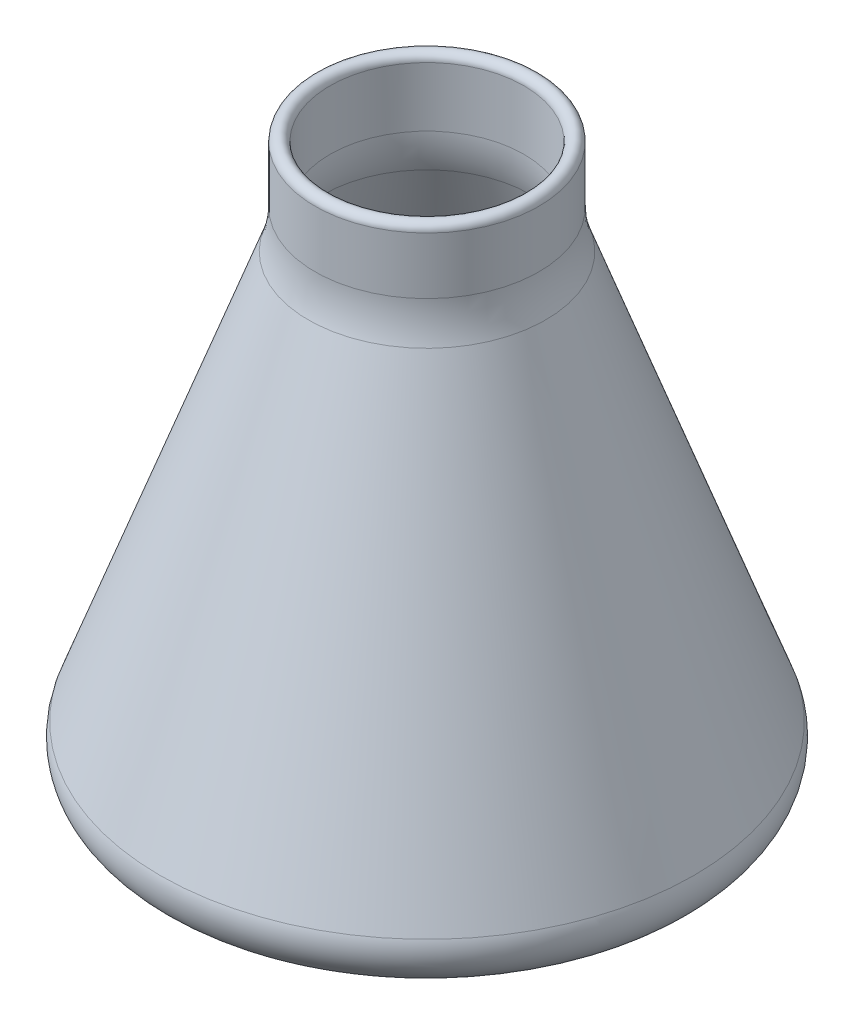
ISO-10303-21;
HEADER;
FILE_DESCRIPTION(('STEP AP214'),'2;1');
FILE_NAME('part.step','',(''),(''),'','','');
FILE_SCHEMA(('AUTOMOTIVE_DESIGN { 1 0 10303 214 1 1 1 1 }'));
ENDSEC;
DATA;
#1=APPLICATION_CONTEXT('core data for automotive mechanical design processes');
#2=APPLICATION_PROTOCOL_DEFINITION('international standard','automotive_design',2000,#1);
#3=PRODUCT_CONTEXT('',#1,'mechanical');
#4=PRODUCT('Part','Part','',(#3));
#5=PRODUCT_RELATED_PRODUCT_CATEGORY('part','',(#4));
#6=PRODUCT_DEFINITION_FORMATION('','',#4);
#7=PRODUCT_DEFINITION_CONTEXT('part definition',#1,'design');
#8=PRODUCT_DEFINITION('design','',#6,#7);
#9=PRODUCT_DEFINITION_SHAPE('','',#8);
#10=(LENGTH_UNIT() NAMED_UNIT(*) SI_UNIT(.MILLI.,.METRE.));
#11=(NAMED_UNIT(*) PLANE_ANGLE_UNIT() SI_UNIT($,.RADIAN.));
#12=(NAMED_UNIT(*) SI_UNIT($,.STERADIAN.) SOLID_ANGLE_UNIT());
#13=UNCERTAINTY_MEASURE_WITH_UNIT(LENGTH_MEASURE(1.E-05),#10,'distance_accuracy_value','');
#14=(GEOMETRIC_REPRESENTATION_CONTEXT(3) GLOBAL_UNCERTAINTY_ASSIGNED_CONTEXT((#13)) GLOBAL_UNIT_ASSIGNED_CONTEXT((#10,
#11,#12)) REPRESENTATION_CONTEXT('',''));
#15=CARTESIAN_POINT('',(0.,0.,0.));
#16=DIRECTION('',(0.,0.,1.));
#17=DIRECTION('',(1.,0.,0.));
#18=AXIS2_PLACEMENT_3D('',#15,#16,#17);
#19=CARTESIAN_POINT('',(0.,296.,0.));
#20=DIRECTION('',(0.,-1.,0.));
#21=DIRECTION('',(0.,0.,-1.));
#22=AXIS2_PLACEMENT_3D('',#19,#20,#21);
#23=TOROIDAL_SURFACE('',#22,56.,4.);
#24=CARTESIAN_POINT('',(0.,296.,0.));
#25=DIRECTION('',(0.,-1.,0.));
#26=DIRECTION('',(0.,0.,-1.));
#27=AXIS2_PLACEMENT_3D('',#24,#25,#26);
#28=CIRCLE('',#27,52.);
#29=CARTESIAN_POINT('',(0.,296.,-52.));
#30=VERTEX_POINT('',#29);
#31=EDGE_CURVE('E68',#30,#30,#28,.F.);
#32=ORIENTED_EDGE('',*,*,#31,.F.);
#33=EDGE_LOOP('',(#32));
#34=FACE_BOUND('',#33,.T.);
#35=CARTESIAN_POINT('',(0.,296.,0.));
#36=DIRECTION('',(0.,-1.,0.));
#37=DIRECTION('',(0.,0.,-1.));
#38=AXIS2_PLACEMENT_3D('',#35,#36,#37);
#39=CIRCLE('',#38,60.);
#40=CARTESIAN_POINT('',(0.,296.,-60.));
#41=VERTEX_POINT('',#40);
#42=EDGE_CURVE('E65',#41,#41,#39,.T.);
#43=ORIENTED_EDGE('',*,*,#42,.F.);
#44=EDGE_LOOP('',(#43));
#45=FACE_BOUND('',#44,.T.);
#46=ADVANCED_FACE('F33',(#34,#45),#23,.T.);
#47=CARTESIAN_POINT('',(152.81240973788,0.,0.));
#48=DIRECTION('',(0.,-1.,0.));
#49=DIRECTION('',(0.,0.,-1.));
#50=AXIS2_PLACEMENT_3D('',#47,#48,#49);
#51=PLANE('',#50);
#52=CARTESIAN_POINT('',(0.,0.,0.));
#53=DIRECTION('',(0.,-1.,0.));
#54=DIRECTION('',(0.,0.,-1.));
#55=AXIS2_PLACEMENT_3D('',#52,#53,#54);
#56=CIRCLE('',#55,124.249449603038);
#57=CARTESIAN_POINT('',(0.,0.,-124.249449603038));
#58=VERTEX_POINT('',#57);
#59=EDGE_CURVE('E40',#58,#58,#56,.T.);
#60=ORIENTED_EDGE('',*,*,#59,.T.);
#61=EDGE_LOOP('',(#60));
#62=FACE_BOUND('',#61,.T.);
#63=ADVANCED_FACE('F76',(#62),#51,.T.);
#64=CARTESIAN_POINT('',(0.,0.,0.));
#65=DIRECTION('',(0.,-1.,0.));
#66=DIRECTION('',(0.,0.,-1.));
#67=AXIS2_PLACEMENT_3D('',#64,#65,#66);
#68=CYLINDRICAL_SURFACE('',#67,60.);
#69=CARTESIAN_POINT('',(0.,265.579618842508,0.));
#70=DIRECTION('',(0.,-1.,0.));
#71=DIRECTION('',(0.,0.,-1.));
#72=AXIS2_PLACEMENT_3D('',#69,#70,#71);
#73=CIRCLE('',#72,60.);
#74=CARTESIAN_POINT('',(0.,265.579618842508,-60.));
#75=VERTEX_POINT('',#74);
#76=EDGE_CURVE('E53',#75,#75,#73,.F.);
#77=ORIENTED_EDGE('',*,*,#76,.T.);
#78=EDGE_LOOP('',(#77));
#79=FACE_BOUND('',#78,.T.);
#80=ORIENTED_EDGE('',*,*,#42,.T.);
#81=EDGE_LOOP('',(#80));
#82=FACE_BOUND('',#81,.T.);
#83=ADVANCED_FACE('F80',(#79,#82),#68,.T.);
#84=CARTESIAN_POINT('',(0.,0.,0.));
#85=DIRECTION('',(0.,-1.,0.));
#86=DIRECTION('',(0.,0.,-1.));
#87=AXIS2_PLACEMENT_3D('',#84,#85,#86);
#88=CONICAL_SURFACE('',#87,152.81240973788,0.34906585039886);
#89=CARTESIAN_POINT('',(0.,26.8404028665132,0.));
#90=DIRECTION('',(0.,1.,0.));
#91=DIRECTION('',(0.,0.,1.));
#92=AXIS2_PLACEMENT_3D('',#89,#90,#91);
#93=CIRCLE('',#92,143.043302018756);
#94=CARTESIAN_POINT('',(0.,26.8404028665132,143.043302018756));
#95=VERTEX_POINT('',#94);
#96=EDGE_CURVE('E10',#95,#95,#93,.T.);
#97=ORIENTED_EDGE('',*,*,#96,.T.);
#98=EDGE_LOOP('',(#97));
#99=FACE_BOUND('',#98,.T.);
#100=CARTESIAN_POINT('',(0.,245.058410242969,0.));
#101=DIRECTION('',(0.,-1.,0.));
#102=DIRECTION('',(0.,0.,-1.));
#103=AXIS2_PLACEMENT_3D('',#100,#101,#102);
#104=CIRCLE('',#103,63.6184427528454);
#105=CARTESIAN_POINT('',(0.,245.058410242969,-63.6184427528454));
#106=VERTEX_POINT('',#105);
#107=EDGE_CURVE('E56',#106,#106,#104,.T.);
#108=ORIENTED_EDGE('',*,*,#107,.T.);
#109=EDGE_LOOP('',(#108));
#110=FACE_BOUND('',#109,.T.);
#111=ADVANCED_FACE('F82',(#99,#110),#88,.T.);
#112=CARTESIAN_POINT('',(152.81240973788,12.,0.));
#113=DIRECTION('',(0.,-1.,0.));
#114=DIRECTION('',(0.,0.,-1.));
#115=AXIS2_PLACEMENT_3D('',#112,#113,#114);
#116=PLANE('',#115);
#117=CARTESIAN_POINT('',(0.,12.,0.));
#118=DIRECTION('',(0.,-1.,0.));
#119=DIRECTION('',(0.,0.,-1.));
#120=AXIS2_PLACEMENT_3D('',#117,#118,#119);
#121=CIRCLE('',#120,111.368384612036);
#122=CARTESIAN_POINT('',(0.,12.,-111.368384612036));
#123=VERTEX_POINT('',#122);
#124=EDGE_CURVE('E44',#123,#123,#121,.F.);
#125=ORIENTED_EDGE('',*,*,#124,.T.);
#126=EDGE_LOOP('',(#125));
#127=FACE_BOUND('',#126,.T.);
#128=ADVANCED_FACE('F89',(#127),#116,.F.);
#129=CARTESIAN_POINT('',(0.,0.,0.));
#130=DIRECTION('',(0.,-1.,0.));
#131=DIRECTION('',(0.,0.,-1.));
#132=AXIS2_PLACEMENT_3D('',#129,#130,#131);
#133=CYLINDRICAL_SURFACE('',#132,52.);
#134=CARTESIAN_POINT('',(0.,264.169002996841,0.));
#135=DIRECTION('',(0.,1.,0.));
#136=DIRECTION('',(0.,0.,1.));
#137=AXIS2_PLACEMENT_3D('',#134,#135,#136);
#138=CIRCLE('',#137,52.);
#139=CARTESIAN_POINT('',(0.,264.169002996841,52.));
#140=VERTEX_POINT('',#139);
#141=EDGE_CURVE('E62',#140,#140,#138,.F.);
#142=ORIENTED_EDGE('',*,*,#141,.T.);
#143=EDGE_LOOP('',(#142));
#144=FACE_BOUND('',#143,.T.);
#145=ORIENTED_EDGE('',*,*,#31,.T.);
#146=EDGE_LOOP('',(#145));
#147=FACE_BOUND('',#146,.T.);
#148=ADVANCED_FACE('F72',(#144,#147),#133,.F.);
#149=CARTESIAN_POINT('',(0.,-2.73616114660533,0.));
#150=DIRECTION('',(0.,-1.,0.));
#151=DIRECTION('',(0.,0.,-1.));
#152=AXIS2_PLACEMENT_3D('',#149,#150,#151);
#153=CONICAL_SURFACE('',#152,145.294868771593,0.34906585039886);
#154=CARTESIAN_POINT('',(0.,38.8404028665132,0.));
#155=DIRECTION('',(0.,-1.,0.));
#156=DIRECTION('',(0.,0.,-1.));
#157=AXIS2_PLACEMENT_3D('',#154,#155,#156);
#158=CIRCLE('',#157,130.162237027755);
#159=CARTESIAN_POINT('',(0.,38.8404028665132,-130.162237027755));
#160=VERTEX_POINT('',#159);
#161=EDGE_CURVE('E48',#160,#160,#158,.T.);
#162=ORIENTED_EDGE('',*,*,#161,.T.);
#163=EDGE_LOOP('',(#162));
#164=FACE_BOUND('',#163,.T.);
#165=CARTESIAN_POINT('',(0.,243.647794397301,0.));
#166=DIRECTION('',(0.,1.,0.));
#167=DIRECTION('',(0.,0.,1.));
#168=AXIS2_PLACEMENT_3D('',#165,#166,#167);
#169=CIRCLE('',#168,55.6184427528454);
#170=CARTESIAN_POINT('',(0.,243.647794397301,55.6184427528454));
#171=VERTEX_POINT('',#170);
#172=EDGE_CURVE('E59',#171,#171,#169,.T.);
#173=ORIENTED_EDGE('',*,*,#172,.T.);
#174=EDGE_LOOP('',(#173));
#175=FACE_BOUND('',#174,.T.);
#176=ADVANCED_FACE('F101',(#164,#175),#153,.F.);
#177=CARTESIAN_POINT('',(0.,264.169002996841,0.));
#178=DIRECTION('',(0.,1.,0.));
#179=DIRECTION('',(0.,0.,1.));
#180=AXIS2_PLACEMENT_3D('',#177,#178,#179);
#181=TOROIDAL_SURFACE('',#180,112.,60.);
#182=ORIENTED_EDGE('',*,*,#172,.F.);
#183=EDGE_LOOP('',(#182));
#184=FACE_BOUND('',#183,.T.);
#185=ORIENTED_EDGE('',*,*,#141,.F.);
#186=EDGE_LOOP('',(#185));
#187=FACE_BOUND('',#186,.T.);
#188=ADVANCED_FACE('F97',(#184,#187),#181,.T.);
#189=CARTESIAN_POINT('',(0.,265.579618842508,0.));
#190=DIRECTION('',(0.,-1.,0.));
#191=DIRECTION('',(0.,0.,-1.));
#192=AXIS2_PLACEMENT_3D('',#189,#190,#191);
#193=TOROIDAL_SURFACE('',#192,120.,60.);
#194=ORIENTED_EDGE('',*,*,#76,.F.);
#195=EDGE_LOOP('',(#194));
#196=FACE_BOUND('',#195,.T.);
#197=ORIENTED_EDGE('',*,*,#107,.F.);
#198=EDGE_LOOP('',(#197));
#199=FACE_BOUND('',#198,.T.);
#200=ADVANCED_FACE('F100',(#196,#199),#193,.F.);
#201=CARTESIAN_POINT('',(0.,32.,0.));
#202=DIRECTION('',(0.,-1.,0.));
#203=DIRECTION('',(0.,0.,-1.));
#204=AXIS2_PLACEMENT_3D('',#201,#202,#203);
#205=TOROIDAL_SURFACE('',#204,111.368384612036,20.);
#206=ORIENTED_EDGE('',*,*,#124,.F.);
#207=EDGE_LOOP('',(#206));
#208=FACE_BOUND('',#207,.T.);
#209=ORIENTED_EDGE('',*,*,#161,.F.);
#210=EDGE_LOOP('',(#209));
#211=FACE_BOUND('',#210,.T.);
#212=ADVANCED_FACE('F104',(#208,#211),#205,.F.);
#213=CARTESIAN_POINT('',(0.,20.,0.));
#214=DIRECTION('',(0.,-1.,0.));
#215=DIRECTION('',(0.,0.,-1.));
#216=AXIS2_PLACEMENT_3D('',#213,#214,#215);
#217=TOROIDAL_SURFACE('',#216,124.249449603038,20.);
#218=ORIENTED_EDGE('',*,*,#96,.F.);
#219=EDGE_LOOP('',(#218));
#220=FACE_BOUND('',#219,.T.);
#221=ORIENTED_EDGE('',*,*,#59,.F.);
#222=EDGE_LOOP('',(#221));
#223=FACE_BOUND('',#222,.T.);
#224=ADVANCED_FACE('F35',(#220,#223),#217,.T.);
#225=CLOSED_SHELL('',(#46,#63,#83,#111,#128,#148,#176,#188,#200,#212,#224));
#226=MANIFOLD_SOLID_BREP('B2',#225);
#227=ADVANCED_BREP_SHAPE_REPRESENTATION('',(#18,#226),#14);
#228=SHAPE_DEFINITION_REPRESENTATION(#9,#227);
ENDSEC;
END-ISO-10303-21;
